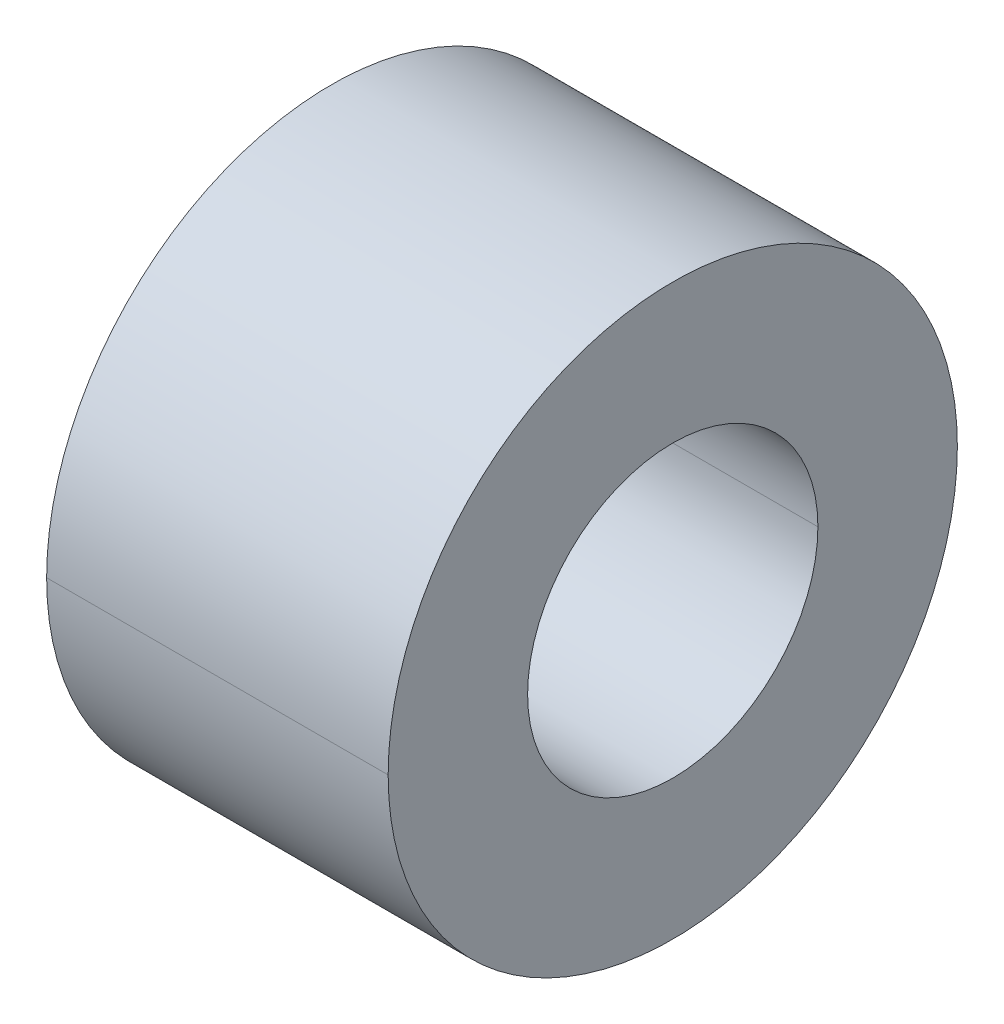
ISO-10303-21;
HEADER;
FILE_DESCRIPTION(('STEP AP214'),'2;1');
FILE_NAME('part.step','',(''),(''),'','','');
FILE_SCHEMA(('AUTOMOTIVE_DESIGN { 1 0 10303 214 1 1 1 1 }'));
ENDSEC;
DATA;
#1=APPLICATION_CONTEXT('core data for automotive mechanical design processes');
#2=APPLICATION_PROTOCOL_DEFINITION('international standard','automotive_design',2000,#1);
#3=PRODUCT_CONTEXT('',#1,'mechanical');
#4=PRODUCT('Part','Part','',(#3));
#5=PRODUCT_RELATED_PRODUCT_CATEGORY('part','',(#4));
#6=PRODUCT_DEFINITION_FORMATION('','',#4);
#7=PRODUCT_DEFINITION_CONTEXT('part definition',#1,'design');
#8=PRODUCT_DEFINITION('design','',#6,#7);
#9=PRODUCT_DEFINITION_SHAPE('','',#8);
#10=(LENGTH_UNIT() NAMED_UNIT(*) SI_UNIT(.MILLI.,.METRE.));
#11=(NAMED_UNIT(*) PLANE_ANGLE_UNIT() SI_UNIT($,.RADIAN.));
#12=(NAMED_UNIT(*) SI_UNIT($,.STERADIAN.) SOLID_ANGLE_UNIT());
#13=UNCERTAINTY_MEASURE_WITH_UNIT(LENGTH_MEASURE(1.E-05),#10,'distance_accuracy_value','');
#14=(GEOMETRIC_REPRESENTATION_CONTEXT(3) GLOBAL_UNCERTAINTY_ASSIGNED_CONTEXT((#13)) GLOBAL_UNIT_ASSIGNED_CONTEXT((#10,
#11,#12)) REPRESENTATION_CONTEXT('',''));
#15=CARTESIAN_POINT('',(0.,0.,0.));
#16=DIRECTION('',(0.,0.,1.));
#17=DIRECTION('',(1.,0.,0.));
#18=AXIS2_PLACEMENT_3D('',#15,#16,#17);
#19=CARTESIAN_POINT('',(3.,0.,0.));
#20=DIRECTION('',(-1.,0.,0.));
#21=DIRECTION('',(0.,0.,1.));
#22=AXIS2_PLACEMENT_3D('',#19,#20,#21);
#23=CYLINDRICAL_SURFACE('',#22,2.55);
#24=DIRECTION('',(-1.,0.,0.));
#25=VECTOR('',#24,1.);
#26=CARTESIAN_POINT('',(3.,0.,-2.55));
#27=LINE('',#26,#25);
#28=CARTESIAN_POINT('',(3.,0.,-2.55));
#29=VERTEX_POINT('',#28);
#30=CARTESIAN_POINT('',(-3.,0.,-2.55));
#31=VERTEX_POINT('',#30);
#32=EDGE_CURVE('E109',#29,#31,#27,.T.);
#33=ORIENTED_EDGE('',*,*,#32,.F.);
#34=CARTESIAN_POINT('',(3.,0.,0.));
#35=DIRECTION('',(-1.,0.,0.));
#36=DIRECTION('',(0.,0.,1.));
#37=AXIS2_PLACEMENT_3D('',#34,#35,#36);
#38=CIRCLE('',#37,2.55);
#39=CARTESIAN_POINT('',(3.,0.,2.55));
#40=VERTEX_POINT('',#39);
#41=EDGE_CURVE('E11',#40,#29,#38,.T.);
#42=ORIENTED_EDGE('',*,*,#41,.F.);
#43=DIRECTION('',(-1.,0.,0.));
#44=VECTOR('',#43,1.);
#45=CARTESIAN_POINT('',(3.,0.,2.55));
#46=LINE('',#45,#44);
#47=CARTESIAN_POINT('',(-3.,0.,2.55));
#48=VERTEX_POINT('',#47);
#49=EDGE_CURVE('E85',#40,#48,#46,.T.);
#50=ORIENTED_EDGE('',*,*,#49,.T.);
#51=CARTESIAN_POINT('',(-3.,0.,0.));
#52=DIRECTION('',(-1.,0.,0.));
#53=DIRECTION('',(0.,0.,1.));
#54=AXIS2_PLACEMENT_3D('',#51,#52,#53);
#55=CIRCLE('',#54,2.55);
#56=EDGE_CURVE('E26',#48,#31,#55,.T.);
#57=ORIENTED_EDGE('',*,*,#56,.T.);
#58=EDGE_LOOP('',(#33,#42,#50,#57));
#59=FACE_BOUND('',#58,.T.);
#60=ADVANCED_FACE('F17',(#59),#23,.F.);
#61=CARTESIAN_POINT('',(3.,0.,0.));
#62=DIRECTION('',(1.,0.,0.));
#63=DIRECTION('',(0.,1.,0.));
#64=AXIS2_PLACEMENT_3D('',#61,#62,#63);
#65=PLANE('',#64);
#66=ORIENTED_EDGE('',*,*,#41,.T.);
#67=CARTESIAN_POINT('',(3.,0.,0.));
#68=DIRECTION('',(-1.,0.,0.));
#69=DIRECTION('',(0.,0.,1.));
#70=AXIS2_PLACEMENT_3D('',#67,#68,#69);
#71=CIRCLE('',#70,2.55);
#72=EDGE_CURVE('E93',#29,#40,#71,.T.);
#73=ORIENTED_EDGE('',*,*,#72,.T.);
#74=EDGE_LOOP('',(#66,#73));
#75=FACE_BOUND('',#74,.T.);
#76=CARTESIAN_POINT('',(3.,0.,0.));
#77=DIRECTION('',(-1.,0.,0.));
#78=DIRECTION('',(0.,0.,1.));
#79=AXIS2_PLACEMENT_3D('',#76,#77,#78);
#80=CIRCLE('',#79,5.);
#81=CARTESIAN_POINT('',(3.,0.,5.));
#82=VERTEX_POINT('',#81);
#83=CARTESIAN_POINT('',(3.,0.,-5.));
#84=VERTEX_POINT('',#83);
#85=EDGE_CURVE('E89',#82,#84,#80,.T.);
#86=ORIENTED_EDGE('',*,*,#85,.F.);
#87=CARTESIAN_POINT('',(3.,0.,0.));
#88=DIRECTION('',(-1.,0.,0.));
#89=DIRECTION('',(0.,0.,1.));
#90=AXIS2_PLACEMENT_3D('',#87,#88,#89);
#91=CIRCLE('',#90,5.);
#92=EDGE_CURVE('E73',#84,#82,#91,.T.);
#93=ORIENTED_EDGE('',*,*,#92,.F.);
#94=EDGE_LOOP('',(#86,#93));
#95=FACE_BOUND('',#94,.T.);
#96=ADVANCED_FACE('F95',(#75,#95),#65,.T.);
#97=CARTESIAN_POINT('',(-3.,0.,0.));
#98=DIRECTION('',(1.,0.,0.));
#99=DIRECTION('',(0.,1.,0.));
#100=AXIS2_PLACEMENT_3D('',#97,#98,#99);
#101=PLANE('',#100);
#102=ORIENTED_EDGE('',*,*,#56,.F.);
#103=CARTESIAN_POINT('',(-3.,0.,0.));
#104=DIRECTION('',(-1.,0.,0.));
#105=DIRECTION('',(0.,0.,1.));
#106=AXIS2_PLACEMENT_3D('',#103,#104,#105);
#107=CIRCLE('',#106,2.55);
#108=EDGE_CURVE('E20',#31,#48,#107,.T.);
#109=ORIENTED_EDGE('',*,*,#108,.F.);
#110=EDGE_LOOP('',(#102,#109));
#111=FACE_BOUND('',#110,.T.);
#112=CARTESIAN_POINT('',(-3.,0.,0.));
#113=DIRECTION('',(1.,0.,0.));
#114=DIRECTION('',(0.,0.,1.));
#115=AXIS2_PLACEMENT_3D('',#112,#113,#114);
#116=CIRCLE('',#115,5.);
#117=CARTESIAN_POINT('',(-3.,0.,5.));
#118=VERTEX_POINT('',#117);
#119=CARTESIAN_POINT('',(-3.,0.,-5.));
#120=VERTEX_POINT('',#119);
#121=EDGE_CURVE('E84',#118,#120,#116,.T.);
#122=ORIENTED_EDGE('',*,*,#121,.F.);
#123=CARTESIAN_POINT('',(-3.,0.,0.));
#124=DIRECTION('',(1.,0.,0.));
#125=DIRECTION('',(0.,0.,1.));
#126=AXIS2_PLACEMENT_3D('',#123,#124,#125);
#127=CIRCLE('',#126,5.);
#128=EDGE_CURVE('E91',#120,#118,#127,.T.);
#129=ORIENTED_EDGE('',*,*,#128,.F.);
#130=EDGE_LOOP('',(#122,#129));
#131=FACE_BOUND('',#130,.T.);
#132=ADVANCED_FACE('F126',(#111,#131),#101,.F.);
#133=CARTESIAN_POINT('',(3.,0.,0.));
#134=DIRECTION('',(-1.,0.,0.));
#135=DIRECTION('',(0.,0.,1.));
#136=AXIS2_PLACEMENT_3D('',#133,#134,#135);
#137=CYLINDRICAL_SURFACE('',#136,5.);
#138=DIRECTION('',(-1.,0.,0.));
#139=VECTOR('',#138,1.);
#140=CARTESIAN_POINT('',(3.,0.,-5.));
#141=LINE('',#140,#139);
#142=EDGE_CURVE('E79',#84,#120,#141,.T.);
#143=ORIENTED_EDGE('',*,*,#142,.F.);
#144=ORIENTED_EDGE('',*,*,#92,.T.);
#145=DIRECTION('',(-1.,0.,0.));
#146=VECTOR('',#145,1.);
#147=CARTESIAN_POINT('',(3.,0.,5.));
#148=LINE('',#147,#146);
#149=EDGE_CURVE('E76',#82,#118,#148,.T.);
#150=ORIENTED_EDGE('',*,*,#149,.T.);
#151=ORIENTED_EDGE('',*,*,#121,.T.);
#152=EDGE_LOOP('',(#143,#144,#150,#151));
#153=FACE_BOUND('',#152,.T.);
#154=ADVANCED_FACE('F75',(#153),#137,.T.);
#155=CARTESIAN_POINT('',(3.,0.,0.));
#156=DIRECTION('',(-1.,0.,0.));
#157=DIRECTION('',(0.,0.,1.));
#158=AXIS2_PLACEMENT_3D('',#155,#156,#157);
#159=CYLINDRICAL_SURFACE('',#158,2.55);
#160=ORIENTED_EDGE('',*,*,#72,.F.);
#161=ORIENTED_EDGE('',*,*,#32,.T.);
#162=ORIENTED_EDGE('',*,*,#108,.T.);
#163=ORIENTED_EDGE('',*,*,#49,.F.);
#164=EDGE_LOOP('',(#160,#161,#162,#163));
#165=FACE_BOUND('',#164,.T.);
#166=ADVANCED_FACE('F125',(#165),#159,.F.);
#167=CARTESIAN_POINT('',(3.,0.,0.));
#168=DIRECTION('',(-1.,0.,0.));
#169=DIRECTION('',(0.,0.,1.));
#170=AXIS2_PLACEMENT_3D('',#167,#168,#169);
#171=CYLINDRICAL_SURFACE('',#170,5.);
#172=ORIENTED_EDGE('',*,*,#85,.T.);
#173=ORIENTED_EDGE('',*,*,#142,.T.);
#174=ORIENTED_EDGE('',*,*,#128,.T.);
#175=ORIENTED_EDGE('',*,*,#149,.F.);
#176=EDGE_LOOP('',(#172,#173,#174,#175));
#177=FACE_BOUND('',#176,.T.);
#178=ADVANCED_FACE('F88',(#177),#171,.T.);
#179=CLOSED_SHELL('',(#60,#96,#132,#154,#166,#178));
#180=MANIFOLD_SOLID_BREP('B1',#179);
#181=ADVANCED_BREP_SHAPE_REPRESENTATION('',(#18,#180),#14);
#182=SHAPE_DEFINITION_REPRESENTATION(#9,#181);
ENDSEC;
END-ISO-10303-21;
